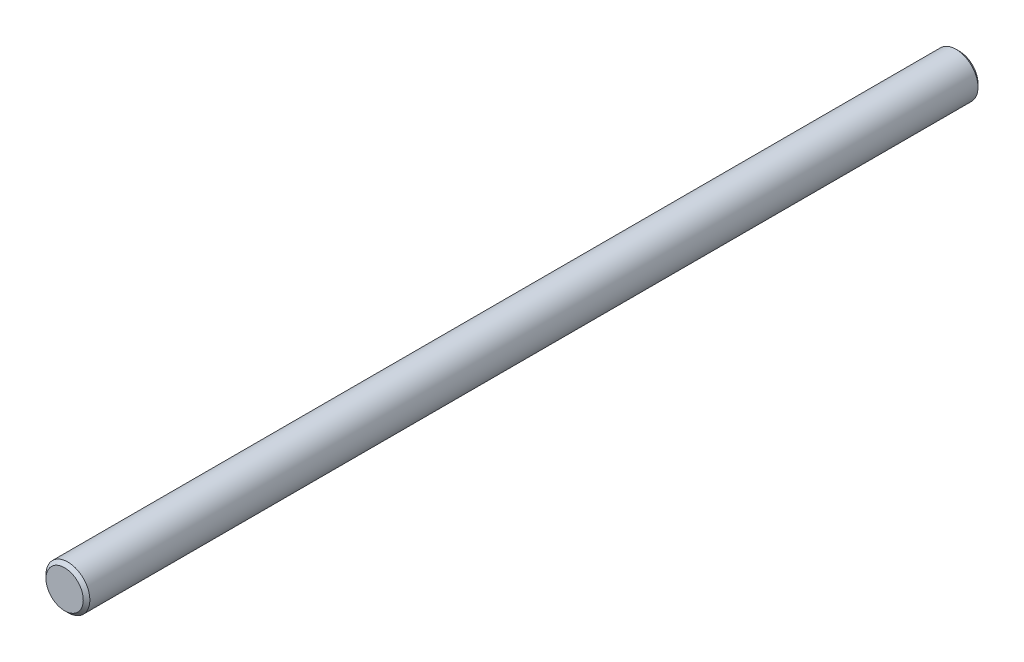
ISO-10303-21;
HEADER;
FILE_DESCRIPTION(('STEP AP214'),'2;1');
FILE_NAME('part.step','',(''),(''),'','','');
FILE_SCHEMA(('AUTOMOTIVE_DESIGN { 1 0 10303 214 1 1 1 1 }'));
ENDSEC;
DATA;
#1=APPLICATION_CONTEXT('core data for automotive mechanical design processes');
#2=APPLICATION_PROTOCOL_DEFINITION('international standard','automotive_design',2000,#1);
#3=PRODUCT_CONTEXT('',#1,'mechanical');
#4=PRODUCT('Part','Part','',(#3));
#5=PRODUCT_RELATED_PRODUCT_CATEGORY('part','',(#4));
#6=PRODUCT_DEFINITION_FORMATION('','',#4);
#7=PRODUCT_DEFINITION_CONTEXT('part definition',#1,'design');
#8=PRODUCT_DEFINITION('design','',#6,#7);
#9=PRODUCT_DEFINITION_SHAPE('','',#8);
#10=(LENGTH_UNIT() NAMED_UNIT(*) SI_UNIT(.MILLI.,.METRE.));
#11=(NAMED_UNIT(*) PLANE_ANGLE_UNIT() SI_UNIT($,.RADIAN.));
#12=(NAMED_UNIT(*) SI_UNIT($,.STERADIAN.) SOLID_ANGLE_UNIT());
#13=UNCERTAINTY_MEASURE_WITH_UNIT(LENGTH_MEASURE(1.E-05),#10,'distance_accuracy_value','');
#14=(GEOMETRIC_REPRESENTATION_CONTEXT(3) GLOBAL_UNCERTAINTY_ASSIGNED_CONTEXT((#13)) GLOBAL_UNIT_ASSIGNED_CONTEXT((#10,
#11,#12)) REPRESENTATION_CONTEXT('',''));
#15=CARTESIAN_POINT('',(0.,0.,0.));
#16=DIRECTION('',(0.,0.,1.));
#17=DIRECTION('',(1.,0.,0.));
#18=AXIS2_PLACEMENT_3D('',#15,#16,#17);
#19=CARTESIAN_POINT('',(0.,0.,80.9244));
#20=DIRECTION('',(0.,0.,-1.));
#21=DIRECTION('',(-1.,0.,0.));
#22=AXIS2_PLACEMENT_3D('',#19,#20,#21);
#23=CYLINDRICAL_SURFACE('',#22,3.96874999999984);
#24=CARTESIAN_POINT('',(0.,0.,-80.3290875));
#25=DIRECTION('',(0.,0.,1.));
#26=DIRECTION('',(1.,0.,0.));
#27=AXIS2_PLACEMENT_3D('',#24,#25,#26);
#28=CIRCLE('',#27,3.96874999999984);
#29=CARTESIAN_POINT('',(3.96874999999984,0.,-80.3290875));
#30=VERTEX_POINT('',#29);
#31=EDGE_CURVE('E44',#30,#30,#28,.T.);
#32=ORIENTED_EDGE('',*,*,#31,.T.);
#33=EDGE_LOOP('',(#32));
#34=FACE_BOUND('',#33,.T.);
#35=CARTESIAN_POINT('',(0.,0.,80.3290875));
#36=DIRECTION('',(0.,0.,1.));
#37=DIRECTION('',(1.,0.,0.));
#38=AXIS2_PLACEMENT_3D('',#35,#36,#37);
#39=CIRCLE('',#38,3.96874999999984);
#40=CARTESIAN_POINT('',(3.96874999999984,0.,80.3290875));
#41=VERTEX_POINT('',#40);
#42=EDGE_CURVE('E48',#41,#41,#39,.F.);
#43=ORIENTED_EDGE('',*,*,#42,.T.);
#44=EDGE_LOOP('',(#43));
#45=FACE_BOUND('',#44,.T.);
#46=ADVANCED_FACE('F33',(#34,#45),#23,.T.);
#47=CARTESIAN_POINT('',(0.,0.,80.9244));
#48=DIRECTION('',(0.,0.,1.));
#49=DIRECTION('',(1.,0.,0.));
#50=AXIS2_PLACEMENT_3D('',#47,#48,#49);
#51=PLANE('',#50);
#52=CARTESIAN_POINT('',(0.,0.,80.9244));
#53=DIRECTION('',(0.,0.,1.));
#54=DIRECTION('',(1.,0.,0.));
#55=AXIS2_PLACEMENT_3D('',#52,#53,#54);
#56=CIRCLE('',#55,3.37343749999985);
#57=CARTESIAN_POINT('',(3.37343749999985,0.,80.9244));
#58=VERTEX_POINT('',#57);
#59=EDGE_CURVE('E10',#58,#58,#56,.T.);
#60=ORIENTED_EDGE('',*,*,#59,.T.);
#61=EDGE_LOOP('',(#60));
#62=FACE_BOUND('',#61,.T.);
#63=ADVANCED_FACE('F64',(#62),#51,.T.);
#64=CARTESIAN_POINT('',(0.,0.,-80.9244));
#65=DIRECTION('',(0.,0.,1.));
#66=DIRECTION('',(1.,0.,0.));
#67=AXIS2_PLACEMENT_3D('',#64,#65,#66);
#68=PLANE('',#67);
#69=CARTESIAN_POINT('',(0.,0.,-80.9244));
#70=DIRECTION('',(0.,0.,1.));
#71=DIRECTION('',(1.,0.,0.));
#72=AXIS2_PLACEMENT_3D('',#69,#70,#71);
#73=CIRCLE('',#72,3.3734374999999);
#74=CARTESIAN_POINT('',(3.3734374999999,0.,-80.9244));
#75=VERTEX_POINT('',#74);
#76=EDGE_CURVE('E40',#75,#75,#73,.F.);
#77=ORIENTED_EDGE('',*,*,#76,.T.);
#78=EDGE_LOOP('',(#77));
#79=FACE_BOUND('',#78,.T.);
#80=ADVANCED_FACE('F61',(#79),#68,.F.);
#81=CARTESIAN_POINT('',(0.,0.,-80.3290875));
#82=DIRECTION('',(0.,0.,1.));
#83=DIRECTION('',(1.,0.,0.));
#84=AXIS2_PLACEMENT_3D('',#81,#82,#83);
#85=CONICAL_SURFACE('',#84,3.96874999999984,0.785398163397422);
#86=ORIENTED_EDGE('',*,*,#76,.F.);
#87=EDGE_LOOP('',(#86));
#88=FACE_BOUND('',#87,.T.);
#89=ORIENTED_EDGE('',*,*,#31,.F.);
#90=EDGE_LOOP('',(#89));
#91=FACE_BOUND('',#90,.T.);
#92=ADVANCED_FACE('F57',(#88,#91),#85,.T.);
#93=CARTESIAN_POINT('',(0.,0.,80.9244));
#94=DIRECTION('',(0.,0.,-1.));
#95=DIRECTION('',(-1.,0.,0.));
#96=AXIS2_PLACEMENT_3D('',#93,#94,#95);
#97=CONICAL_SURFACE('',#96,3.37343749999985,0.785398163397445);
#98=ORIENTED_EDGE('',*,*,#42,.F.);
#99=EDGE_LOOP('',(#98));
#100=FACE_BOUND('',#99,.T.);
#101=ORIENTED_EDGE('',*,*,#59,.F.);
#102=EDGE_LOOP('',(#101));
#103=FACE_BOUND('',#102,.T.);
#104=ADVANCED_FACE('F35',(#100,#103),#97,.T.);
#105=CLOSED_SHELL('',(#46,#63,#80,#92,#104));
#106=MANIFOLD_SOLID_BREP('B2',#105);
#107=ADVANCED_BREP_SHAPE_REPRESENTATION('',(#18,#106),#14);
#108=SHAPE_DEFINITION_REPRESENTATION(#9,#107);
ENDSEC;
END-ISO-10303-21;
